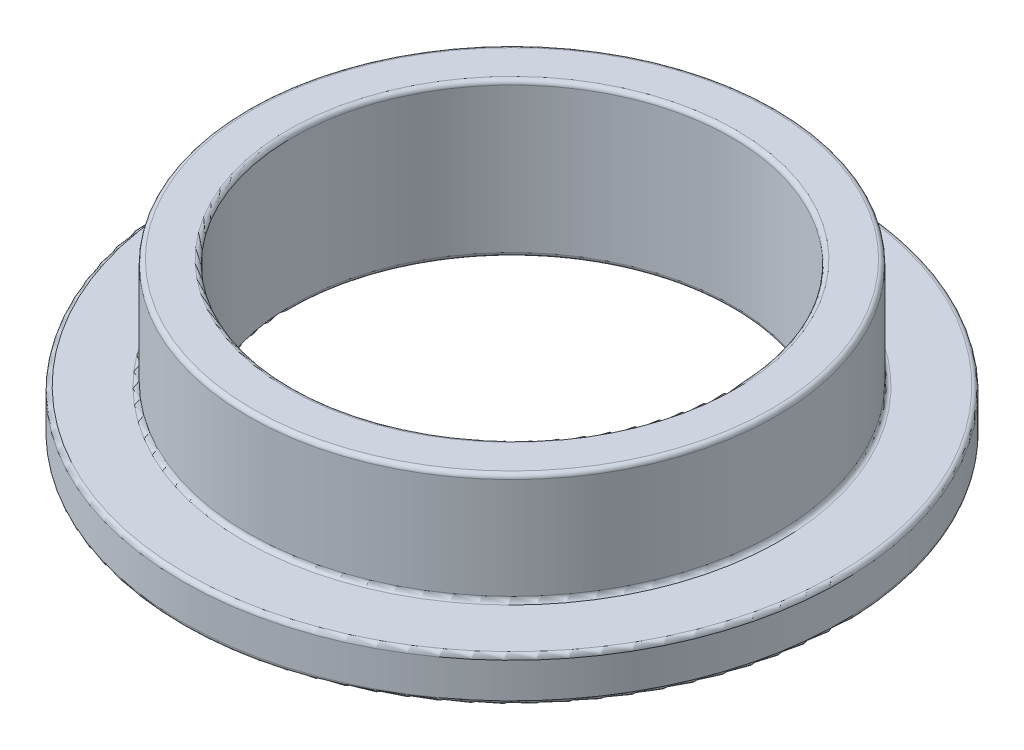
ISO-10303-21;
HEADER;
FILE_DESCRIPTION(('STEP AP214'),'2;1');
FILE_NAME('part.step','',(''),(''),'','','');
FILE_SCHEMA(('AUTOMOTIVE_DESIGN { 1 0 10303 214 1 1 1 1 }'));
ENDSEC;
DATA;
#1=APPLICATION_CONTEXT('core data for automotive mechanical design processes');
#2=APPLICATION_PROTOCOL_DEFINITION('international standard','automotive_design',2000,#1);
#3=PRODUCT_CONTEXT('',#1,'mechanical');
#4=PRODUCT('Part','Part','',(#3));
#5=PRODUCT_RELATED_PRODUCT_CATEGORY('part','',(#4));
#6=PRODUCT_DEFINITION_FORMATION('','',#4);
#7=PRODUCT_DEFINITION_CONTEXT('part definition',#1,'design');
#8=PRODUCT_DEFINITION('design','',#6,#7);
#9=PRODUCT_DEFINITION_SHAPE('','',#8);
#10=(LENGTH_UNIT() NAMED_UNIT(*) SI_UNIT(.MILLI.,.METRE.));
#11=(NAMED_UNIT(*) PLANE_ANGLE_UNIT() SI_UNIT($,.RADIAN.));
#12=(NAMED_UNIT(*) SI_UNIT($,.STERADIAN.) SOLID_ANGLE_UNIT());
#13=UNCERTAINTY_MEASURE_WITH_UNIT(LENGTH_MEASURE(1.E-05),#10,'distance_accuracy_value','');
#14=(GEOMETRIC_REPRESENTATION_CONTEXT(3) GLOBAL_UNCERTAINTY_ASSIGNED_CONTEXT((#13)) GLOBAL_UNIT_ASSIGNED_CONTEXT((#10,
#11,#12)) REPRESENTATION_CONTEXT('',''));
#15=CARTESIAN_POINT('',(0.,0.,0.));
#16=DIRECTION('',(0.,0.,1.));
#17=DIRECTION('',(1.,0.,0.));
#18=AXIS2_PLACEMENT_3D('',#15,#16,#17);
#19=CARTESIAN_POINT('',(0.,3.5,0.));
#20=DIRECTION('',(0.,1.,0.));
#21=DIRECTION('',(0.,0.,1.));
#22=AXIS2_PLACEMENT_3D('',#19,#20,#21);
#23=PLANE('',#22);
#24=CARTESIAN_POINT('',(0.,3.5,0.));
#25=DIRECTION('',(0.,1.,0.));
#26=DIRECTION('',(0.,0.,1.));
#27=AXIS2_PLACEMENT_3D('',#24,#25,#26);
#28=CIRCLE('',#27,5.1);
#29=CARTESIAN_POINT('',(0.,3.5,5.1));
#30=VERTEX_POINT('',#29);
#31=EDGE_CURVE('E10',#30,#30,#28,.F.);
#32=ORIENTED_EDGE('',*,*,#31,.T.);
#33=EDGE_LOOP('',(#32));
#34=FACE_BOUND('',#33,.T.);
#35=CARTESIAN_POINT('',(0.,3.5,0.));
#36=DIRECTION('',(0.,1.,0.));
#37=DIRECTION('',(0.,0.,1.));
#38=AXIS2_PLACEMENT_3D('',#35,#36,#37);
#39=CIRCLE('',#38,5.9);
#40=CARTESIAN_POINT('',(0.,3.5,5.9));
#41=VERTEX_POINT('',#40);
#42=EDGE_CURVE('E42',#41,#41,#39,.T.);
#43=ORIENTED_EDGE('',*,*,#42,.T.);
#44=EDGE_LOOP('',(#43));
#45=FACE_BOUND('',#44,.T.);
#46=ADVANCED_FACE('F35',(#34,#45),#23,.T.);
#47=CARTESIAN_POINT('',(0.,0.,0.));
#48=DIRECTION('',(0.,1.,0.));
#49=DIRECTION('',(0.,0.,1.));
#50=AXIS2_PLACEMENT_3D('',#47,#48,#49);
#51=PLANE('',#50);
#52=CARTESIAN_POINT('',(0.,0.,0.));
#53=DIRECTION('',(0.,1.,0.));
#54=DIRECTION('',(0.,0.,1.));
#55=AXIS2_PLACEMENT_3D('',#52,#53,#54);
#56=CIRCLE('',#55,5.1);
#57=CARTESIAN_POINT('',(0.,0.,5.1));
#58=VERTEX_POINT('',#57);
#59=EDGE_CURVE('E73',#58,#58,#56,.T.);
#60=ORIENTED_EDGE('',*,*,#59,.T.);
#61=EDGE_LOOP('',(#60));
#62=FACE_BOUND('',#61,.T.);
#63=CARTESIAN_POINT('',(0.,0.,0.));
#64=DIRECTION('',(0.,1.,0.));
#65=DIRECTION('',(0.,0.,1.));
#66=AXIS2_PLACEMENT_3D('',#63,#64,#65);
#67=CIRCLE('',#66,7.4);
#68=CARTESIAN_POINT('',(0.,0.,7.4));
#69=VERTEX_POINT('',#68);
#70=EDGE_CURVE('E76',#69,#69,#67,.F.);
#71=ORIENTED_EDGE('',*,*,#70,.T.);
#72=EDGE_LOOP('',(#71));
#73=FACE_BOUND('',#72,.T.);
#74=ADVANCED_FACE('F80',(#62,#73),#51,.F.);
#75=CARTESIAN_POINT('',(0.,3.5,0.));
#76=DIRECTION('',(0.,-1.,0.));
#77=DIRECTION('',(0.,0.,-1.));
#78=AXIS2_PLACEMENT_3D('',#75,#76,#77);
#79=CYLINDRICAL_SURFACE('',#78,6.);
#80=CARTESIAN_POINT('',(0.,1.1,0.));
#81=DIRECTION('',(0.,1.,0.));
#82=DIRECTION('',(0.,0.,1.));
#83=AXIS2_PLACEMENT_3D('',#80,#81,#82);
#84=CIRCLE('',#83,6.);
#85=CARTESIAN_POINT('',(0.,1.1,6.));
#86=VERTEX_POINT('',#85);
#87=EDGE_CURVE('E55',#86,#86,#84,.T.);
#88=ORIENTED_EDGE('',*,*,#87,.T.);
#89=EDGE_LOOP('',(#88));
#90=FACE_BOUND('',#89,.T.);
#91=CARTESIAN_POINT('',(0.,3.4,0.));
#92=DIRECTION('',(0.,1.,0.));
#93=DIRECTION('',(0.,0.,1.));
#94=AXIS2_PLACEMENT_3D('',#91,#92,#93);
#95=CIRCLE('',#94,6.);
#96=CARTESIAN_POINT('',(0.,3.4,6.));
#97=VERTEX_POINT('',#96);
#98=EDGE_CURVE('E58',#97,#97,#95,.F.);
#99=ORIENTED_EDGE('',*,*,#98,.T.);
#100=EDGE_LOOP('',(#99));
#101=FACE_BOUND('',#100,.T.);
#102=ADVANCED_FACE('F111',(#90,#101),#79,.T.);
#103=CARTESIAN_POINT('',(0.,3.5,0.));
#104=DIRECTION('',(0.,-1.,0.));
#105=DIRECTION('',(0.,0.,-1.));
#106=AXIS2_PLACEMENT_3D('',#103,#104,#105);
#107=CYLINDRICAL_SURFACE('',#106,5.);
#108=CARTESIAN_POINT('',(0.,0.0999999999999998,0.));
#109=DIRECTION('',(0.,1.,0.));
#110=DIRECTION('',(0.,0.,1.));
#111=AXIS2_PLACEMENT_3D('',#108,#109,#110);
#112=CIRCLE('',#111,5.);
#113=CARTESIAN_POINT('',(0.,0.0999999999999998,5.));
#114=VERTEX_POINT('',#113);
#115=EDGE_CURVE('E67',#114,#114,#112,.F.);
#116=ORIENTED_EDGE('',*,*,#115,.T.);
#117=EDGE_LOOP('',(#116));
#118=FACE_BOUND('',#117,.T.);
#119=CARTESIAN_POINT('',(0.,3.4,0.));
#120=DIRECTION('',(0.,1.,0.));
#121=DIRECTION('',(0.,0.,1.));
#122=AXIS2_PLACEMENT_3D('',#119,#120,#121);
#123=CIRCLE('',#122,5.);
#124=CARTESIAN_POINT('',(0.,3.4,5.));
#125=VERTEX_POINT('',#124);
#126=EDGE_CURVE('E70',#125,#125,#123,.T.);
#127=ORIENTED_EDGE('',*,*,#126,.T.);
#128=EDGE_LOOP('',(#127));
#129=FACE_BOUND('',#128,.T.);
#130=ADVANCED_FACE('F105',(#118,#129),#107,.F.);
#131=CARTESIAN_POINT('',(0.,1.,0.));
#132=DIRECTION('',(0.,1.,0.));
#133=DIRECTION('',(0.,0.,1.));
#134=AXIS2_PLACEMENT_3D('',#131,#132,#133);
#135=PLANE('',#134);
#136=CARTESIAN_POINT('',(0.,1.,0.));
#137=DIRECTION('',(0.,1.,0.));
#138=DIRECTION('',(0.,0.,1.));
#139=AXIS2_PLACEMENT_3D('',#136,#137,#138);
#140=CIRCLE('',#139,6.1);
#141=CARTESIAN_POINT('',(0.,1.,6.1));
#142=VERTEX_POINT('',#141);
#143=EDGE_CURVE('E46',#142,#142,#140,.F.);
#144=ORIENTED_EDGE('',*,*,#143,.T.);
#145=EDGE_LOOP('',(#144));
#146=FACE_BOUND('',#145,.T.);
#147=CARTESIAN_POINT('',(0.,1.,0.));
#148=DIRECTION('',(0.,1.,0.));
#149=DIRECTION('',(0.,0.,1.));
#150=AXIS2_PLACEMENT_3D('',#147,#148,#149);
#151=CIRCLE('',#150,7.4);
#152=CARTESIAN_POINT('',(0.,1.,7.4));
#153=VERTEX_POINT('',#152);
#154=EDGE_CURVE('E50',#153,#153,#151,.T.);
#155=ORIENTED_EDGE('',*,*,#154,.T.);
#156=EDGE_LOOP('',(#155));
#157=FACE_BOUND('',#156,.T.);
#158=ADVANCED_FACE('F93',(#146,#157),#135,.T.);
#159=CARTESIAN_POINT('',(0.,1.,0.));
#160=DIRECTION('',(0.,-1.,0.));
#161=DIRECTION('',(0.,0.,-1.));
#162=AXIS2_PLACEMENT_3D('',#159,#160,#161);
#163=CYLINDRICAL_SURFACE('',#162,7.5);
#164=CARTESIAN_POINT('',(0.,0.1,0.));
#165=DIRECTION('',(0.,1.,0.));
#166=DIRECTION('',(0.,0.,1.));
#167=AXIS2_PLACEMENT_3D('',#164,#165,#166);
#168=CIRCLE('',#167,7.5);
#169=CARTESIAN_POINT('',(0.,0.1,7.5));
#170=VERTEX_POINT('',#169);
#171=EDGE_CURVE('E61',#170,#170,#168,.T.);
#172=ORIENTED_EDGE('',*,*,#171,.T.);
#173=EDGE_LOOP('',(#172));
#174=FACE_BOUND('',#173,.T.);
#175=CARTESIAN_POINT('',(0.,0.9,0.));
#176=DIRECTION('',(0.,1.,0.));
#177=DIRECTION('',(0.,0.,1.));
#178=AXIS2_PLACEMENT_3D('',#175,#176,#177);
#179=CIRCLE('',#178,7.5);
#180=CARTESIAN_POINT('',(0.,0.9,7.5));
#181=VERTEX_POINT('',#180);
#182=EDGE_CURVE('E64',#181,#181,#179,.F.);
#183=ORIENTED_EDGE('',*,*,#182,.T.);
#184=EDGE_LOOP('',(#183));
#185=FACE_BOUND('',#184,.T.);
#186=ADVANCED_FACE('F90',(#174,#185),#163,.T.);
#187=CARTESIAN_POINT('',(0.,0.0999999999999998,0.));
#188=DIRECTION('',(0.,1.,0.));
#189=DIRECTION('',(0.,0.,1.));
#190=AXIS2_PLACEMENT_3D('',#187,#188,#189);
#191=TOROIDAL_SURFACE('',#190,5.1,0.1);
#192=ORIENTED_EDGE('',*,*,#115,.F.);
#193=EDGE_LOOP('',(#192));
#194=FACE_BOUND('',#193,.T.);
#195=ORIENTED_EDGE('',*,*,#59,.F.);
#196=EDGE_LOOP('',(#195));
#197=FACE_BOUND('',#196,.T.);
#198=ADVANCED_FACE('F86',(#194,#197),#191,.T.);
#199=CARTESIAN_POINT('',(0.,0.1,0.));
#200=DIRECTION('',(0.,1.,0.));
#201=DIRECTION('',(0.,0.,1.));
#202=AXIS2_PLACEMENT_3D('',#199,#200,#201);
#203=TOROIDAL_SURFACE('',#202,7.4,0.1);
#204=ORIENTED_EDGE('',*,*,#70,.F.);
#205=EDGE_LOOP('',(#204));
#206=FACE_BOUND('',#205,.T.);
#207=ORIENTED_EDGE('',*,*,#171,.F.);
#208=EDGE_LOOP('',(#207));
#209=FACE_BOUND('',#208,.T.);
#210=ADVANCED_FACE('F82',(#206,#209),#203,.T.);
#211=CARTESIAN_POINT('',(0.,1.1,0.));
#212=DIRECTION('',(0.,1.,0.));
#213=DIRECTION('',(0.,0.,1.));
#214=AXIS2_PLACEMENT_3D('',#211,#212,#213);
#215=TOROIDAL_SURFACE('',#214,6.1,0.1);
#216=ORIENTED_EDGE('',*,*,#143,.F.);
#217=EDGE_LOOP('',(#216));
#218=FACE_BOUND('',#217,.T.);
#219=ORIENTED_EDGE('',*,*,#87,.F.);
#220=EDGE_LOOP('',(#219));
#221=FACE_BOUND('',#220,.T.);
#222=ADVANCED_FACE('F85',(#218,#221),#215,.F.);
#223=CARTESIAN_POINT('',(0.,0.9,0.));
#224=DIRECTION('',(0.,1.,0.));
#225=DIRECTION('',(0.,0.,1.));
#226=AXIS2_PLACEMENT_3D('',#223,#224,#225);
#227=TOROIDAL_SURFACE('',#226,7.4,0.1);
#228=ORIENTED_EDGE('',*,*,#182,.F.);
#229=EDGE_LOOP('',(#228));
#230=FACE_BOUND('',#229,.T.);
#231=ORIENTED_EDGE('',*,*,#154,.F.);
#232=EDGE_LOOP('',(#231));
#233=FACE_BOUND('',#232,.T.);
#234=ADVANCED_FACE('F97',(#230,#233),#227,.T.);
#235=CARTESIAN_POINT('',(0.,3.4,0.));
#236=DIRECTION('',(0.,1.,0.));
#237=DIRECTION('',(0.,0.,1.));
#238=AXIS2_PLACEMENT_3D('',#235,#236,#237);
#239=TOROIDAL_SURFACE('',#238,5.1,0.1);
#240=ORIENTED_EDGE('',*,*,#31,.F.);
#241=EDGE_LOOP('',(#240));
#242=FACE_BOUND('',#241,.T.);
#243=ORIENTED_EDGE('',*,*,#126,.F.);
#244=EDGE_LOOP('',(#243));
#245=FACE_BOUND('',#244,.T.);
#246=ADVANCED_FACE('F100',(#242,#245),#239,.T.);
#247=CARTESIAN_POINT('',(0.,3.4,0.));
#248=DIRECTION('',(0.,1.,0.));
#249=DIRECTION('',(0.,0.,1.));
#250=AXIS2_PLACEMENT_3D('',#247,#248,#249);
#251=TOROIDAL_SURFACE('',#250,5.9,0.1);
#252=ORIENTED_EDGE('',*,*,#98,.F.);
#253=EDGE_LOOP('',(#252));
#254=FACE_BOUND('',#253,.T.);
#255=ORIENTED_EDGE('',*,*,#42,.F.);
#256=EDGE_LOOP('',(#255));
#257=FACE_BOUND('',#256,.T.);
#258=ADVANCED_FACE('F37',(#254,#257),#251,.T.);
#259=CLOSED_SHELL('',(#46,#74,#102,#130,#158,#186,#198,#210,#222,#234,#246,#258));
#260=MANIFOLD_SOLID_BREP('B2',#259);
#261=ADVANCED_BREP_SHAPE_REPRESENTATION('',(#18,#260),#14);
#262=SHAPE_DEFINITION_REPRESENTATION(#9,#261);
ENDSEC;
END-ISO-10303-21;
